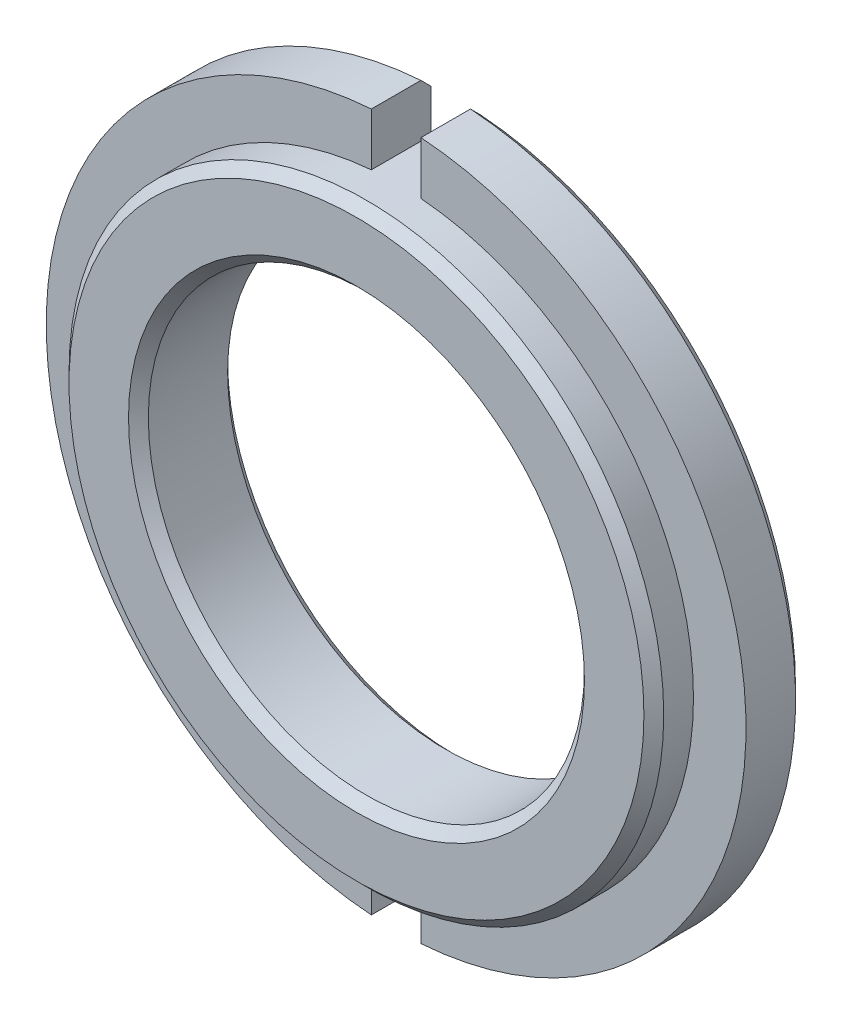
ISO-10303-21;
HEADER;
FILE_DESCRIPTION(('STEP AP214'),'2;1');
FILE_NAME('part.step','',(''),(''),'','','');
FILE_SCHEMA(('AUTOMOTIVE_DESIGN { 1 0 10303 214 1 1 1 1 }'));
ENDSEC;
DATA;
#1=APPLICATION_CONTEXT('core data for automotive mechanical design processes');
#2=APPLICATION_PROTOCOL_DEFINITION('international standard','automotive_design',2000,#1);
#3=PRODUCT_CONTEXT('',#1,'mechanical');
#4=PRODUCT('Part','Part','',(#3));
#5=PRODUCT_RELATED_PRODUCT_CATEGORY('part','',(#4));
#6=PRODUCT_DEFINITION_FORMATION('','',#4);
#7=PRODUCT_DEFINITION_CONTEXT('part definition',#1,'design');
#8=PRODUCT_DEFINITION('design','',#6,#7);
#9=PRODUCT_DEFINITION_SHAPE('','',#8);
#10=(LENGTH_UNIT() NAMED_UNIT(*) SI_UNIT(.MILLI.,.METRE.));
#11=(NAMED_UNIT(*) PLANE_ANGLE_UNIT() SI_UNIT($,.RADIAN.));
#12=(NAMED_UNIT(*) SI_UNIT($,.STERADIAN.) SOLID_ANGLE_UNIT());
#13=UNCERTAINTY_MEASURE_WITH_UNIT(LENGTH_MEASURE(1.E-05),#10,'distance_accuracy_value','');
#14=(GEOMETRIC_REPRESENTATION_CONTEXT(3) GLOBAL_UNCERTAINTY_ASSIGNED_CONTEXT((#13)) GLOBAL_UNIT_ASSIGNED_CONTEXT((#10,
#11,#12)) REPRESENTATION_CONTEXT('',''));
#15=CARTESIAN_POINT('',(0.,0.,0.));
#16=DIRECTION('',(0.,0.,1.));
#17=DIRECTION('',(1.,0.,0.));
#18=AXIS2_PLACEMENT_3D('',#15,#16,#17);
#19=CARTESIAN_POINT('',(0.,0.,5.));
#20=DIRECTION('',(0.,0.,-1.));
#21=DIRECTION('',(-1.,0.,0.));
#22=AXIS2_PLACEMENT_3D('',#19,#20,#21);
#23=CYLINDRICAL_SURFACE('',#22,17.65);
#24=DIRECTION('',(0.,0.,1.));
#25=VECTOR('',#24,1.);
#26=CARTESIAN_POINT('',(1.25,-17.6056809013455,-0.00100000000000013));
#27=LINE('',#26,#25);
#28=CARTESIAN_POINT('',(1.25,-17.6056809013455,0.500000000000005));
#29=VERTEX_POINT('',#28);
#30=CARTESIAN_POINT('',(1.25,-17.6056809013455,3.));
#31=VERTEX_POINT('',#30);
#32=EDGE_CURVE('E147',#29,#31,#27,.T.);
#33=ORIENTED_EDGE('',*,*,#32,.F.);
#34=CARTESIAN_POINT('',(0.,0.,0.5));
#35=DIRECTION('',(0.,0.,1.));
#36=DIRECTION('',(1.,0.,0.));
#37=AXIS2_PLACEMENT_3D('',#34,#35,#36);
#38=CIRCLE('',#37,17.65);
#39=CARTESIAN_POINT('',(1.25000000000001,17.6056809013455,0.500000000000005));
#40=VERTEX_POINT('',#39);
#41=EDGE_CURVE('E191',#29,#40,#38,.T.);
#42=ORIENTED_EDGE('',*,*,#41,.T.);
#43=DIRECTION('',(0.,0.,1.));
#44=VECTOR('',#43,1.);
#45=CARTESIAN_POINT('',(1.25000000000001,17.6056809013455,-0.00100000000000013));
#46=LINE('',#45,#44);
#47=CARTESIAN_POINT('',(1.25000000000001,17.6056809013455,3.));
#48=VERTEX_POINT('',#47);
#49=EDGE_CURVE('E165',#40,#48,#46,.T.);
#50=ORIENTED_EDGE('',*,*,#49,.T.);
#51=CARTESIAN_POINT('',(0.,0.,3.));
#52=DIRECTION('',(0.,0.,1.));
#53=DIRECTION('',(1.,0.,0.));
#54=AXIS2_PLACEMENT_3D('',#51,#52,#53);
#55=CIRCLE('',#54,17.65);
#56=EDGE_CURVE('E172',#31,#48,#55,.T.);
#57=ORIENTED_EDGE('',*,*,#56,.F.);
#58=EDGE_LOOP('',(#33,#42,#50,#57));
#59=FACE_BOUND('',#58,.T.);
#60=ADVANCED_FACE('F32',(#59),#23,.T.);
#61=CARTESIAN_POINT('',(0.,0.,3.));
#62=DIRECTION('',(0.,0.,1.));
#63=DIRECTION('',(1.,0.,0.));
#64=AXIS2_PLACEMENT_3D('',#61,#62,#63);
#65=PLANE('',#64);
#66=DIRECTION('',(0.,1.,0.));
#67=VECTOR('',#66,1.);
#68=CARTESIAN_POINT('',(1.25,-14.9478259288767,3.));
#69=LINE('',#68,#67);
#70=CARTESIAN_POINT('',(1.25,-14.9478259288767,3.));
#71=VERTEX_POINT('',#70);
#72=EDGE_CURVE('E134',#31,#71,#69,.T.);
#73=ORIENTED_EDGE('',*,*,#72,.F.);
#74=ORIENTED_EDGE('',*,*,#56,.T.);
#75=DIRECTION('',(0.,1.,0.));
#76=VECTOR('',#75,1.);
#77=CARTESIAN_POINT('',(1.25,17.6056809013455,3.));
#78=LINE('',#77,#76);
#79=CARTESIAN_POINT('',(1.25,14.9478259288767,3.));
#80=VERTEX_POINT('',#79);
#81=EDGE_CURVE('E154',#80,#48,#78,.T.);
#82=ORIENTED_EDGE('',*,*,#81,.F.);
#83=CARTESIAN_POINT('',(0.,0.,3.));
#84=DIRECTION('',(0.,0.,1.));
#85=DIRECTION('',(1.,0.,0.));
#86=AXIS2_PLACEMENT_3D('',#83,#84,#85);
#87=CIRCLE('',#86,15.);
#88=EDGE_CURVE('E170',#71,#80,#87,.T.);
#89=ORIENTED_EDGE('',*,*,#88,.F.);
#90=EDGE_LOOP('',(#73,#74,#82,#89));
#91=FACE_BOUND('',#90,.T.);
#92=ADVANCED_FACE('F223',(#91),#65,.T.);
#93=CARTESIAN_POINT('',(0.,0.,5.));
#94=DIRECTION('',(0.,0.,1.));
#95=DIRECTION('',(1.,0.,0.));
#96=AXIS2_PLACEMENT_3D('',#93,#94,#95);
#97=PLANE('',#96);
#98=CARTESIAN_POINT('',(0.,0.,5.));
#99=DIRECTION('',(0.,0.,1.));
#100=DIRECTION('',(1.,0.,0.));
#101=AXIS2_PLACEMENT_3D('',#98,#99,#100);
#102=CIRCLE('',#101,11.5);
#103=CARTESIAN_POINT('',(11.5,0.,5.));
#104=VERTEX_POINT('',#103);
#105=EDGE_CURVE('E185',#104,#104,#102,.F.);
#106=ORIENTED_EDGE('',*,*,#105,.T.);
#107=EDGE_LOOP('',(#106));
#108=FACE_BOUND('',#107,.T.);
#109=CARTESIAN_POINT('',(0.,0.,5.));
#110=DIRECTION('',(0.,0.,1.));
#111=DIRECTION('',(1.,0.,0.));
#112=AXIS2_PLACEMENT_3D('',#109,#110,#111);
#113=CIRCLE('',#112,14.5);
#114=CARTESIAN_POINT('',(14.5,0.,5.));
#115=VERTEX_POINT('',#114);
#116=EDGE_CURVE('E182',#115,#115,#113,.T.);
#117=ORIENTED_EDGE('',*,*,#116,.T.);
#118=EDGE_LOOP('',(#117));
#119=FACE_BOUND('',#118,.T.);
#120=ADVANCED_FACE('F227',(#108,#119),#97,.T.);
#121=DIRECTION('',(0.,0.,1.));
#122=VECTOR('',#121,1.);
#123=CARTESIAN_POINT('',(-1.25,17.6056809013455,-0.00100000000000013));
#124=LINE('',#123,#122);
#125=CARTESIAN_POINT('',(-1.25,17.6056809013455,0.500000000000005));
#126=VERTEX_POINT('',#125);
#127=CARTESIAN_POINT('',(-1.25,17.6056809013455,3.));
#128=VERTEX_POINT('',#127);
#129=EDGE_CURVE('E163',#126,#128,#124,.T.);
#130=ORIENTED_EDGE('',*,*,#129,.F.);
#131=CARTESIAN_POINT('',(0.,0.,0.5));
#132=DIRECTION('',(0.,0.,1.));
#133=DIRECTION('',(1.,0.,0.));
#134=AXIS2_PLACEMENT_3D('',#131,#132,#133);
#135=CIRCLE('',#134,17.65);
#136=CARTESIAN_POINT('',(-1.25,-17.6056809013455,0.500000000000005));
#137=VERTEX_POINT('',#136);
#138=EDGE_CURVE('E273',#126,#137,#135,.T.);
#139=ORIENTED_EDGE('',*,*,#138,.T.);
#140=DIRECTION('',(0.,0.,1.));
#141=VECTOR('',#140,1.);
#142=CARTESIAN_POINT('',(-1.25,-17.6056809013455,-0.00100000000000013));
#143=LINE('',#142,#141);
#144=CARTESIAN_POINT('',(-1.25,-17.6056809013455,3.));
#145=VERTEX_POINT('',#144);
#146=EDGE_CURVE('E133',#137,#145,#143,.T.);
#147=ORIENTED_EDGE('',*,*,#146,.T.);
#148=EDGE_CURVE('E173',#128,#145,#55,.T.);
#149=ORIENTED_EDGE('',*,*,#148,.F.);
#150=EDGE_LOOP('',(#130,#139,#147,#149));
#151=FACE_BOUND('',#150,.T.);
#152=ADVANCED_FACE('F230',(#151),#23,.T.);
#153=CARTESIAN_POINT('',(0.,0.,0.));
#154=DIRECTION('',(0.,0.,1.));
#155=DIRECTION('',(1.,0.,0.));
#156=AXIS2_PLACEMENT_3D('',#153,#154,#155);
#157=PLANE('',#156);
#158=CARTESIAN_POINT('',(0.,0.,0.));
#159=DIRECTION('',(0.,0.,1.));
#160=DIRECTION('',(1.,0.,0.));
#161=AXIS2_PLACEMENT_3D('',#158,#159,#160);
#162=CIRCLE('',#161,11.5);
#163=CARTESIAN_POINT('',(11.5,0.,0.));
#164=VERTEX_POINT('',#163);
#165=EDGE_CURVE('E201',#164,#164,#162,.T.);
#166=ORIENTED_EDGE('',*,*,#165,.T.);
#167=EDGE_LOOP('',(#166));
#168=FACE_BOUND('',#167,.T.);
#169=DIRECTION('',(0.,-1.,0.));
#170=VECTOR('',#169,1.);
#171=CARTESIAN_POINT('',(1.25,17.6056809013455,0.));
#172=LINE('',#171,#170);
#173=CARTESIAN_POINT('',(1.25,17.1043854025802,0.));
#174=VERTEX_POINT('',#173);
#175=CARTESIAN_POINT('',(1.25,14.9478259288767,0.));
#176=VERTEX_POINT('',#175);
#177=EDGE_CURVE('E162',#174,#176,#172,.T.);
#178=ORIENTED_EDGE('',*,*,#177,.F.);
#179=CARTESIAN_POINT('',(0.,0.,0.));
#180=DIRECTION('',(0.,0.,1.));
#181=DIRECTION('',(1.,0.,0.));
#182=AXIS2_PLACEMENT_3D('',#179,#180,#181);
#183=CIRCLE('',#182,17.15);
#184=CARTESIAN_POINT('',(1.25,-17.1043854025802,0.));
#185=VERTEX_POINT('',#184);
#186=EDGE_CURVE('E267',#174,#185,#183,.F.);
#187=ORIENTED_EDGE('',*,*,#186,.T.);
#188=DIRECTION('',(0.,-1.,0.));
#189=VECTOR('',#188,1.);
#190=CARTESIAN_POINT('',(1.25,-14.9478259288767,0.));
#191=LINE('',#190,#189);
#192=CARTESIAN_POINT('',(1.25,-14.9478259288767,0.));
#193=VERTEX_POINT('',#192);
#194=EDGE_CURVE('E139',#193,#185,#191,.T.);
#195=ORIENTED_EDGE('',*,*,#194,.F.);
#196=CARTESIAN_POINT('',(0.,0.,0.));
#197=DIRECTION('',(0.,0.,1.));
#198=DIRECTION('',(1.,0.,0.));
#199=AXIS2_PLACEMENT_3D('',#196,#197,#198);
#200=CIRCLE('',#199,15.);
#201=CARTESIAN_POINT('',(-1.25,-14.9478259288767,0.));
#202=VERTEX_POINT('',#201);
#203=EDGE_CURVE('E128',#202,#193,#200,.T.);
#204=ORIENTED_EDGE('',*,*,#203,.F.);
#205=DIRECTION('',(0.,1.,0.));
#206=VECTOR('',#205,1.);
#207=CARTESIAN_POINT('',(-1.25,-14.9478259288767,0.));
#208=LINE('',#207,#206);
#209=CARTESIAN_POINT('',(-1.25,-17.1043854025802,0.));
#210=VERTEX_POINT('',#209);
#211=EDGE_CURVE('E111',#210,#202,#208,.T.);
#212=ORIENTED_EDGE('',*,*,#211,.F.);
#213=CARTESIAN_POINT('',(0.,0.,0.));
#214=DIRECTION('',(0.,0.,1.));
#215=DIRECTION('',(1.,0.,0.));
#216=AXIS2_PLACEMENT_3D('',#213,#214,#215);
#217=CIRCLE('',#216,17.15);
#218=CARTESIAN_POINT('',(-1.25,17.1043854025802,0.));
#219=VERTEX_POINT('',#218);
#220=EDGE_CURVE('E276',#210,#219,#217,.F.);
#221=ORIENTED_EDGE('',*,*,#220,.T.);
#222=DIRECTION('',(0.,1.,0.));
#223=VECTOR('',#222,1.);
#224=CARTESIAN_POINT('',(-1.25,17.6056809013455,0.));
#225=LINE('',#224,#223);
#226=CARTESIAN_POINT('',(-1.25,14.9478259288767,0.));
#227=VERTEX_POINT('',#226);
#228=EDGE_CURVE('E152',#227,#219,#225,.T.);
#229=ORIENTED_EDGE('',*,*,#228,.F.);
#230=CARTESIAN_POINT('',(0.,0.,0.));
#231=DIRECTION('',(0.,0.,1.));
#232=DIRECTION('',(1.,0.,0.));
#233=AXIS2_PLACEMENT_3D('',#230,#231,#232);
#234=CIRCLE('',#233,15.);
#235=EDGE_CURVE('E120',#176,#227,#234,.T.);
#236=ORIENTED_EDGE('',*,*,#235,.F.);
#237=EDGE_LOOP('',(#178,#187,#195,#204,#212,#221,#229,#236));
#238=FACE_BOUND('',#237,.T.);
#239=ADVANCED_FACE('F137',(#168,#238),#157,.F.);
#240=CARTESIAN_POINT('',(0.,0.,5.));
#241=DIRECTION('',(0.,0.,-1.));
#242=DIRECTION('',(-1.,0.,0.));
#243=AXIS2_PLACEMENT_3D('',#240,#241,#242);
#244=CYLINDRICAL_SURFACE('',#243,11.);
#245=CARTESIAN_POINT('',(0.,0.,4.49999999999999));
#246=DIRECTION('',(0.,0.,1.));
#247=DIRECTION('',(1.,0.,0.));
#248=AXIS2_PLACEMENT_3D('',#245,#246,#247);
#249=CIRCLE('',#248,11.);
#250=CARTESIAN_POINT('',(11.,0.,4.49999999999999));
#251=VERTEX_POINT('',#250);
#252=EDGE_CURVE('E179',#251,#251,#249,.T.);
#253=ORIENTED_EDGE('',*,*,#252,.T.);
#254=EDGE_LOOP('',(#253));
#255=FACE_BOUND('',#254,.T.);
#256=CARTESIAN_POINT('',(0.,0.,0.499999999999995));
#257=DIRECTION('',(0.,0.,1.));
#258=DIRECTION('',(1.,0.,0.));
#259=AXIS2_PLACEMENT_3D('',#256,#257,#258);
#260=CIRCLE('',#259,11.);
#261=CARTESIAN_POINT('',(11.,0.,0.499999999999995));
#262=VERTEX_POINT('',#261);
#263=EDGE_CURVE('E176',#262,#262,#260,.F.);
#264=ORIENTED_EDGE('',*,*,#263,.T.);
#265=EDGE_LOOP('',(#264));
#266=FACE_BOUND('',#265,.T.);
#267=ADVANCED_FACE('F221',(#255,#266),#244,.F.);
#268=DIRECTION('',(0.,-1.,0.));
#269=VECTOR('',#268,1.);
#270=CARTESIAN_POINT('',(-1.25,-14.9478259288767,3.));
#271=LINE('',#270,#269);
#272=CARTESIAN_POINT('',(-1.25,-14.9478259288767,3.));
#273=VERTEX_POINT('',#272);
#274=EDGE_CURVE('E141',#273,#145,#271,.T.);
#275=ORIENTED_EDGE('',*,*,#274,.F.);
#276=CARTESIAN_POINT('',(-1.25,14.9478259288767,3.));
#277=VERTEX_POINT('',#276);
#278=EDGE_CURVE('E132',#277,#273,#87,.T.);
#279=ORIENTED_EDGE('',*,*,#278,.F.);
#280=DIRECTION('',(0.,-1.,0.));
#281=VECTOR('',#280,1.);
#282=CARTESIAN_POINT('',(-1.25,17.6056809013455,3.));
#283=LINE('',#282,#281);
#284=EDGE_CURVE('E157',#128,#277,#283,.T.);
#285=ORIENTED_EDGE('',*,*,#284,.F.);
#286=ORIENTED_EDGE('',*,*,#148,.T.);
#287=EDGE_LOOP('',(#275,#279,#285,#286));
#288=FACE_BOUND('',#287,.T.);
#289=ADVANCED_FACE('F217',(#288),#65,.T.);
#290=CARTESIAN_POINT('',(0.,0.,3.));
#291=DIRECTION('',(0.,0.,1.));
#292=DIRECTION('',(1.,0.,0.));
#293=AXIS2_PLACEMENT_3D('',#290,#291,#292);
#294=CYLINDRICAL_SURFACE('',#293,15.);
#295=CARTESIAN_POINT('',(0.,0.,4.5));
#296=DIRECTION('',(0.,0.,1.));
#297=DIRECTION('',(1.,0.,0.));
#298=AXIS2_PLACEMENT_3D('',#295,#296,#297);
#299=CIRCLE('',#298,15.);
#300=CARTESIAN_POINT('',(15.,0.,4.5));
#301=VERTEX_POINT('',#300);
#302=EDGE_CURVE('E188',#301,#301,#299,.F.);
#303=ORIENTED_EDGE('',*,*,#302,.T.);
#304=EDGE_LOOP('',(#303));
#305=FACE_BOUND('',#304,.T.);
#306=ORIENTED_EDGE('',*,*,#278,.T.);
#307=DIRECTION('',(0.,0.,1.));
#308=VECTOR('',#307,1.);
#309=CARTESIAN_POINT('',(-1.25,-14.9478259288767,-0.00100000000000013));
#310=LINE('',#309,#308);
#311=EDGE_CURVE('E116',#202,#273,#310,.T.);
#312=ORIENTED_EDGE('',*,*,#311,.F.);
#313=ORIENTED_EDGE('',*,*,#203,.T.);
#314=DIRECTION('',(0.,0.,1.));
#315=VECTOR('',#314,1.);
#316=CARTESIAN_POINT('',(1.25,-14.9478259288767,-0.00100000000000013));
#317=LINE('',#316,#315);
#318=EDGE_CURVE('E121',#193,#71,#317,.T.);
#319=ORIENTED_EDGE('',*,*,#318,.T.);
#320=ORIENTED_EDGE('',*,*,#88,.T.);
#321=DIRECTION('',(0.,0.,1.));
#322=VECTOR('',#321,1.);
#323=CARTESIAN_POINT('',(1.25,14.9478259288767,-0.00100000000000013));
#324=LINE('',#323,#322);
#325=EDGE_CURVE('E159',#176,#80,#324,.T.);
#326=ORIENTED_EDGE('',*,*,#325,.F.);
#327=ORIENTED_EDGE('',*,*,#235,.T.);
#328=DIRECTION('',(0.,0.,1.));
#329=VECTOR('',#328,1.);
#330=CARTESIAN_POINT('',(-1.25,14.9478259288767,-0.00100000000000013));
#331=LINE('',#330,#329);
#332=EDGE_CURVE('E160',#227,#277,#331,.T.);
#333=ORIENTED_EDGE('',*,*,#332,.T.);
#334=EDGE_LOOP('',(#306,#312,#313,#319,#320,#326,#327,#333));
#335=FACE_BOUND('',#334,.T.);
#336=ADVANCED_FACE('F126',(#305,#335),#294,.T.);
#337=CARTESIAN_POINT('',(-1.25,17.6056809013455,-0.00100000000000013));
#338=DIRECTION('',(-1.,0.,0.));
#339=DIRECTION('',(0.,0.,1.));
#340=AXIS2_PLACEMENT_3D('',#337,#338,#339);
#341=PLANE('',#340);
#342=ORIENTED_EDGE('',*,*,#228,.T.);
#343=CARTESIAN_POINT('',(-1.25,17.1043854025802,0.));
#344=CARTESIAN_POINT('',(-1.25,17.1879377586314,0.0833302190288848));
#345=CARTESIAN_POINT('',(-1.25,17.2714885615543,0.166661995210202));
#346=CARTESIAN_POINT('',(-1.25,17.4385870611427,0.333328661876869));
#347=CARTESIAN_POINT('',(-1.25,17.5221347578082,0.416663552362218));
#348=CARTESIAN_POINT('',(-1.25,17.6056809013454,0.5));
#349=B_SPLINE_CURVE_WITH_KNOTS('',3,(#343,#344,#345,#346,#347,#348),.UNSPECIFIED.,.F.,.F.,(4,2,
4),(0.,0.354011714940833,0.708023429878131),.UNSPECIFIED.);
#350=EDGE_CURVE('E11',#219,#126,#349,.T.);
#351=ORIENTED_EDGE('',*,*,#350,.T.);
#352=ORIENTED_EDGE('',*,*,#129,.T.);
#353=ORIENTED_EDGE('',*,*,#284,.T.);
#354=ORIENTED_EDGE('',*,*,#332,.F.);
#355=EDGE_LOOP('',(#342,#351,#352,#353,#354));
#356=FACE_BOUND('',#355,.T.);
#357=ADVANCED_FACE('F211',(#356),#341,.F.);
#358=CARTESIAN_POINT('',(1.25,17.6056809013455,-0.00100000000000013));
#359=DIRECTION('',(1.,0.,0.));
#360=DIRECTION('',(0.,0.,-1.));
#361=AXIS2_PLACEMENT_3D('',#358,#359,#360);
#362=PLANE('',#361);
#363=ORIENTED_EDGE('',*,*,#49,.F.);
#364=CARTESIAN_POINT('',(1.25000000000001,17.6056809013454,0.5));
#365=CARTESIAN_POINT('',(1.25000000000001,17.5221347578082,0.416663552362219));
#366=CARTESIAN_POINT('',(1.25,17.4385870611427,0.333328661876869));
#367=CARTESIAN_POINT('',(1.25,17.2714885615543,0.166661995210202));
#368=CARTESIAN_POINT('',(1.25,17.1879377586314,0.0833302190288852));
#369=CARTESIAN_POINT('',(1.25,17.1043854025802,0.));
#370=B_SPLINE_CURVE_WITH_KNOTS('',3,(#364,#365,#366,#367,#368,#369),.UNSPECIFIED.,.F.,.F.,(4,2,
4),(0.,0.354011714937298,0.708023429878131),.UNSPECIFIED.);
#371=EDGE_CURVE('E194',#40,#174,#370,.T.);
#372=ORIENTED_EDGE('',*,*,#371,.T.);
#373=ORIENTED_EDGE('',*,*,#177,.T.);
#374=ORIENTED_EDGE('',*,*,#325,.T.);
#375=ORIENTED_EDGE('',*,*,#81,.T.);
#376=EDGE_LOOP('',(#363,#372,#373,#374,#375));
#377=FACE_BOUND('',#376,.T.);
#378=ADVANCED_FACE('F206',(#377),#362,.F.);
#379=CARTESIAN_POINT('',(1.25,-14.9478259288767,-0.00100000000000013));
#380=DIRECTION('',(1.,0.,0.));
#381=DIRECTION('',(0.,0.,-1.));
#382=AXIS2_PLACEMENT_3D('',#379,#380,#381);
#383=PLANE('',#382);
#384=ORIENTED_EDGE('',*,*,#194,.T.);
#385=CARTESIAN_POINT('',(1.25,-17.1043854025802,0.));
#386=CARTESIAN_POINT('',(1.25,-17.1879377586314,0.0833302190288848));
#387=CARTESIAN_POINT('',(1.25,-17.2714885615543,0.166661995210202));
#388=CARTESIAN_POINT('',(1.25,-17.4385870611427,0.333328661876869));
#389=CARTESIAN_POINT('',(1.25,-17.5221347578082,0.416663552362218));
#390=CARTESIAN_POINT('',(1.25,-17.6056809013454,0.5));
#391=B_SPLINE_CURVE_WITH_KNOTS('',3,(#385,#386,#387,#388,#389,#390),.UNSPECIFIED.,.F.,.F.,(4,2,
4),(0.,0.354011714940833,0.708023429878131),.UNSPECIFIED.);
#392=EDGE_CURVE('E266',#185,#29,#391,.T.);
#393=ORIENTED_EDGE('',*,*,#392,.T.);
#394=ORIENTED_EDGE('',*,*,#32,.T.);
#395=ORIENTED_EDGE('',*,*,#72,.T.);
#396=ORIENTED_EDGE('',*,*,#318,.F.);
#397=EDGE_LOOP('',(#384,#393,#394,#395,#396));
#398=FACE_BOUND('',#397,.T.);
#399=ADVANCED_FACE('F210',(#398),#383,.F.);
#400=CARTESIAN_POINT('',(-1.25,-14.9478259288767,-0.00100000000000013));
#401=DIRECTION('',(-1.,0.,0.));
#402=DIRECTION('',(0.,0.,1.));
#403=AXIS2_PLACEMENT_3D('',#400,#401,#402);
#404=PLANE('',#403);
#405=ORIENTED_EDGE('',*,*,#146,.F.);
#406=CARTESIAN_POINT('',(-1.25,-17.6056809013454,0.5));
#407=CARTESIAN_POINT('',(-1.25,-17.5221347578082,0.416663552362219));
#408=CARTESIAN_POINT('',(-1.25,-17.4385870611427,0.333328661876869));
#409=CARTESIAN_POINT('',(-1.25,-17.2714885615543,0.166661995210202));
#410=CARTESIAN_POINT('',(-1.25,-17.1879377586314,0.0833302190288852));
#411=CARTESIAN_POINT('',(-1.25,-17.1043854025802,0.));
#412=B_SPLINE_CURVE_WITH_KNOTS('',3,(#406,#407,#408,#409,#410,#411),.UNSPECIFIED.,.F.,.F.,(4,2,
4),(0.,0.354011714937298,0.70802342987813),.UNSPECIFIED.);
#413=EDGE_CURVE('E44',#137,#210,#412,.T.);
#414=ORIENTED_EDGE('',*,*,#413,.T.);
#415=ORIENTED_EDGE('',*,*,#211,.T.);
#416=ORIENTED_EDGE('',*,*,#311,.T.);
#417=ORIENTED_EDGE('',*,*,#274,.T.);
#418=EDGE_LOOP('',(#405,#414,#415,#416,#417));
#419=FACE_BOUND('',#418,.T.);
#420=ADVANCED_FACE('F114',(#419),#404,.F.);
#421=CARTESIAN_POINT('',(0.,0.,4.49999999999999));
#422=DIRECTION('',(0.,0.,1.));
#423=DIRECTION('',(1.,0.,0.));
#424=AXIS2_PLACEMENT_3D('',#421,#422,#423);
#425=CONICAL_SURFACE('',#424,11.,0.785398163397447);
#426=ORIENTED_EDGE('',*,*,#105,.F.);
#427=EDGE_LOOP('',(#426));
#428=FACE_BOUND('',#427,.T.);
#429=ORIENTED_EDGE('',*,*,#252,.F.);
#430=EDGE_LOOP('',(#429));
#431=FACE_BOUND('',#430,.T.);
#432=ADVANCED_FACE('F238',(#428,#431),#425,.F.);
#433=CARTESIAN_POINT('',(0.,0.,5.));
#434=DIRECTION('',(0.,0.,-1.));
#435=DIRECTION('',(-1.,0.,0.));
#436=AXIS2_PLACEMENT_3D('',#433,#434,#435);
#437=CONICAL_SURFACE('',#436,14.5,0.785398163397448);
#438=ORIENTED_EDGE('',*,*,#302,.F.);
#439=EDGE_LOOP('',(#438));
#440=FACE_BOUND('',#439,.T.);
#441=ORIENTED_EDGE('',*,*,#116,.F.);
#442=EDGE_LOOP('',(#441));
#443=FACE_BOUND('',#442,.T.);
#444=ADVANCED_FACE('F240',(#440,#443),#437,.T.);
#445=CARTESIAN_POINT('',(0.,0.,0.5));
#446=DIRECTION('',(0.,0.,1.));
#447=DIRECTION('',(1.,0.,0.));
#448=AXIS2_PLACEMENT_3D('',#445,#446,#447);
#449=CONICAL_SURFACE('',#448,17.65,0.785398163397448);
#450=ORIENTED_EDGE('',*,*,#392,.F.);
#451=ORIENTED_EDGE('',*,*,#186,.F.);
#452=ORIENTED_EDGE('',*,*,#371,.F.);
#453=ORIENTED_EDGE('',*,*,#41,.F.);
#454=EDGE_LOOP('',(#450,#451,#452,#453));
#455=FACE_BOUND('',#454,.T.);
#456=ADVANCED_FACE('F203',(#455),#449,.T.);
#457=CARTESIAN_POINT('',(0.,0.,0.5));
#458=DIRECTION('',(0.,0.,1.));
#459=DIRECTION('',(1.,0.,0.));
#460=AXIS2_PLACEMENT_3D('',#457,#458,#459);
#461=CONICAL_SURFACE('',#460,17.65,0.785398163397448);
#462=ORIENTED_EDGE('',*,*,#350,.F.);
#463=ORIENTED_EDGE('',*,*,#220,.F.);
#464=ORIENTED_EDGE('',*,*,#413,.F.);
#465=ORIENTED_EDGE('',*,*,#138,.F.);
#466=EDGE_LOOP('',(#462,#463,#464,#465));
#467=FACE_BOUND('',#466,.T.);
#468=ADVANCED_FACE('F247',(#467),#461,.T.);
#469=CARTESIAN_POINT('',(0.,0.,0.));
#470=DIRECTION('',(0.,0.,-1.));
#471=DIRECTION('',(-1.,0.,0.));
#472=AXIS2_PLACEMENT_3D('',#469,#470,#471);
#473=CONICAL_SURFACE('',#472,11.5,0.785398163397447);
#474=ORIENTED_EDGE('',*,*,#263,.F.);
#475=EDGE_LOOP('',(#474));
#476=FACE_BOUND('',#475,.T.);
#477=ORIENTED_EDGE('',*,*,#165,.F.);
#478=EDGE_LOOP('',(#477));
#479=FACE_BOUND('',#478,.T.);
#480=ADVANCED_FACE('F34',(#476,#479),#473,.F.);
#481=CLOSED_SHELL('',(#60,#92,#120,#152,#239,#267,#289,#336,#357,#378,#399,#420,#432,#444,#456,
#468,#480));
#482=MANIFOLD_SOLID_BREP('B2',#481);
#483=ADVANCED_BREP_SHAPE_REPRESENTATION('',(#18,#482),#14);
#484=SHAPE_DEFINITION_REPRESENTATION(#9,#483);
ENDSEC;
END-ISO-10303-21;
